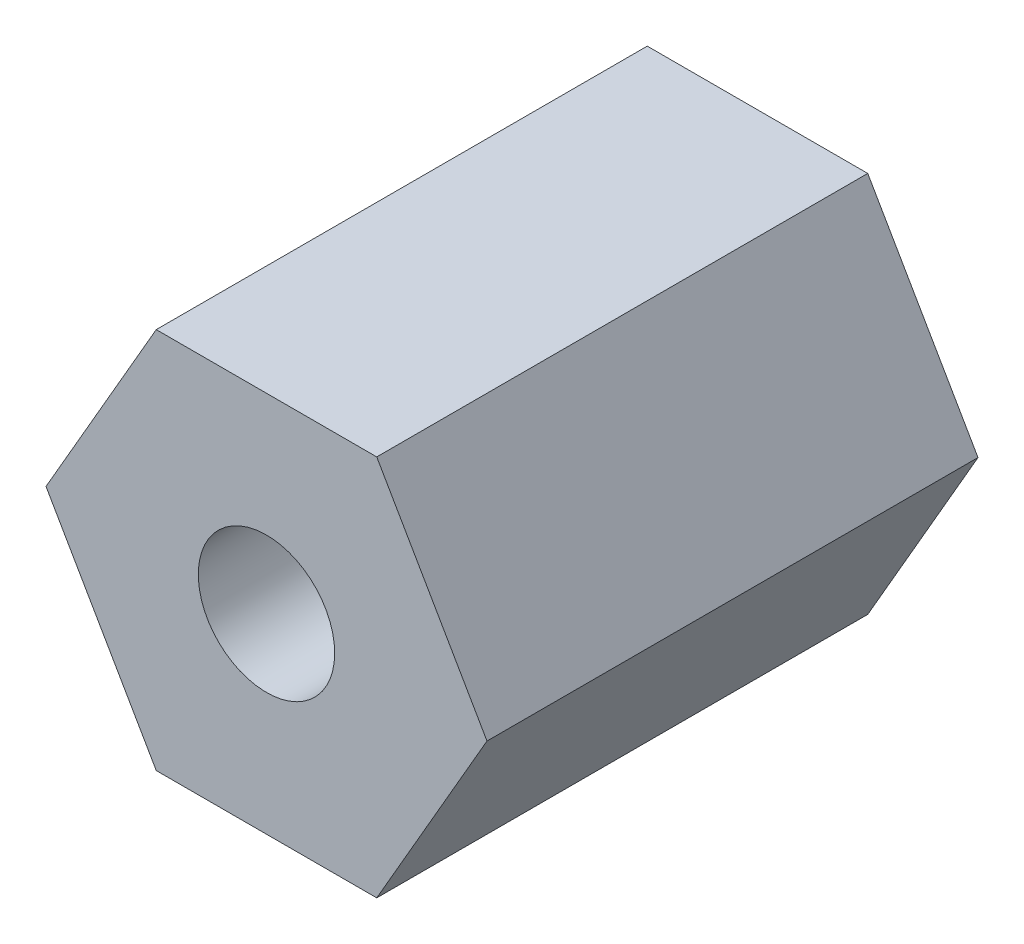
ISO-10303-21;
HEADER;
FILE_DESCRIPTION(('STEP AP214'),'2;1');
FILE_NAME('part.step','',(''),(''),'','','');
FILE_SCHEMA(('AUTOMOTIVE_DESIGN { 1 0 10303 214 1 1 1 1 }'));
ENDSEC;
DATA;
#1=APPLICATION_CONTEXT('core data for automotive mechanical design processes');
#2=APPLICATION_PROTOCOL_DEFINITION('international standard','automotive_design',2000,#1);
#3=PRODUCT_CONTEXT('',#1,'mechanical');
#4=PRODUCT('Part','Part','',(#3));
#5=PRODUCT_RELATED_PRODUCT_CATEGORY('part','',(#4));
#6=PRODUCT_DEFINITION_FORMATION('','',#4);
#7=PRODUCT_DEFINITION_CONTEXT('part definition',#1,'design');
#8=PRODUCT_DEFINITION('design','',#6,#7);
#9=PRODUCT_DEFINITION_SHAPE('','',#8);
#10=(LENGTH_UNIT() NAMED_UNIT(*) SI_UNIT(.MILLI.,.METRE.));
#11=(NAMED_UNIT(*) PLANE_ANGLE_UNIT() SI_UNIT($,.RADIAN.));
#12=(NAMED_UNIT(*) SI_UNIT($,.STERADIAN.) SOLID_ANGLE_UNIT());
#13=UNCERTAINTY_MEASURE_WITH_UNIT(LENGTH_MEASURE(1.E-05),#10,'distance_accuracy_value','');
#14=(GEOMETRIC_REPRESENTATION_CONTEXT(3) GLOBAL_UNCERTAINTY_ASSIGNED_CONTEXT((#13)) GLOBAL_UNIT_ASSIGNED_CONTEXT((#10,
#11,#12)) REPRESENTATION_CONTEXT('',''));
#15=CARTESIAN_POINT('',(0.,0.,0.));
#16=DIRECTION('',(0.,0.,1.));
#17=DIRECTION('',(1.,0.,0.));
#18=AXIS2_PLACEMENT_3D('',#15,#16,#17);
#19=CARTESIAN_POINT('',(2.02072594216369,3.5,9.));
#20=DIRECTION('',(0.,-1.,0.));
#21=DIRECTION('',(1.,0.,0.));
#22=AXIS2_PLACEMENT_3D('',#19,#20,#21);
#23=PLANE('',#22);
#24=DIRECTION('',(-1.,0.,0.));
#25=VECTOR('',#24,1.);
#26=CARTESIAN_POINT('',(2.02072594216369,3.5,0.));
#27=LINE('',#26,#25);
#28=CARTESIAN_POINT('',(2.02072594216369,3.5,0.));
#29=VERTEX_POINT('',#28);
#30=CARTESIAN_POINT('',(-2.02072594216369,3.5,0.));
#31=VERTEX_POINT('',#30);
#32=EDGE_CURVE('E117',#29,#31,#27,.T.);
#33=ORIENTED_EDGE('',*,*,#32,.T.);
#34=DIRECTION('',(0.,0.,-1.));
#35=VECTOR('',#34,1.);
#36=CARTESIAN_POINT('',(-2.02072594216369,3.5,9.));
#37=LINE('',#36,#35);
#38=CARTESIAN_POINT('',(-2.02072594216369,3.5,9.));
#39=VERTEX_POINT('',#38);
#40=EDGE_CURVE('E11',#39,#31,#37,.T.);
#41=ORIENTED_EDGE('',*,*,#40,.F.);
#42=DIRECTION('',(-1.,0.,0.));
#43=VECTOR('',#42,1.);
#44=CARTESIAN_POINT('',(2.02072594216369,3.5,9.));
#45=LINE('',#44,#43);
#46=CARTESIAN_POINT('',(2.02072594216369,3.5,9.));
#47=VERTEX_POINT('',#46);
#48=EDGE_CURVE('E128',#47,#39,#45,.T.);
#49=ORIENTED_EDGE('',*,*,#48,.F.);
#50=DIRECTION('',(0.,0.,-1.));
#51=VECTOR('',#50,1.);
#52=CARTESIAN_POINT('',(2.02072594216369,3.5,9.));
#53=LINE('',#52,#51);
#54=EDGE_CURVE('E113',#47,#29,#53,.T.);
#55=ORIENTED_EDGE('',*,*,#54,.T.);
#56=EDGE_LOOP('',(#33,#41,#49,#55));
#57=FACE_BOUND('',#56,.T.);
#58=ADVANCED_FACE('F33',(#57),#23,.F.);
#59=CARTESIAN_POINT('',(-2.02072594216369,3.5,9.));
#60=DIRECTION('',(0.866025403784439,-0.5,0.));
#61=DIRECTION('',(0.5,0.866025403784439,0.));
#62=AXIS2_PLACEMENT_3D('',#59,#60,#61);
#63=PLANE('',#62);
#64=DIRECTION('',(-0.5,-0.866025403784439,0.));
#65=VECTOR('',#64,1.);
#66=CARTESIAN_POINT('',(-2.02072594216369,3.5,0.));
#67=LINE('',#66,#65);
#68=CARTESIAN_POINT('',(-4.04145188432738,0.,0.));
#69=VERTEX_POINT('',#68);
#70=EDGE_CURVE('E120',#31,#69,#67,.T.);
#71=ORIENTED_EDGE('',*,*,#70,.T.);
#72=DIRECTION('',(0.,0.,-1.));
#73=VECTOR('',#72,1.);
#74=CARTESIAN_POINT('',(-4.04145188432738,0.,9.));
#75=LINE('',#74,#73);
#76=CARTESIAN_POINT('',(-4.04145188432738,0.,9.));
#77=VERTEX_POINT('',#76);
#78=EDGE_CURVE('E41',#77,#69,#75,.T.);
#79=ORIENTED_EDGE('',*,*,#78,.F.);
#80=DIRECTION('',(-0.5,-0.866025403784439,0.));
#81=VECTOR('',#80,1.);
#82=CARTESIAN_POINT('',(-2.02072594216369,3.5,9.));
#83=LINE('',#82,#81);
#84=EDGE_CURVE('E86',#39,#77,#83,.T.);
#85=ORIENTED_EDGE('',*,*,#84,.F.);
#86=ORIENTED_EDGE('',*,*,#40,.T.);
#87=EDGE_LOOP('',(#71,#79,#85,#86));
#88=FACE_BOUND('',#87,.T.);
#89=ADVANCED_FACE('F153',(#88),#63,.F.);
#90=CARTESIAN_POINT('',(-4.04145188432738,0.,9.));
#91=DIRECTION('',(0.866025403784438,0.5,0.));
#92=DIRECTION('',(-0.5,0.866025403784439,0.));
#93=AXIS2_PLACEMENT_3D('',#90,#91,#92);
#94=PLANE('',#93);
#95=DIRECTION('',(0.5,-0.866025403784439,0.));
#96=VECTOR('',#95,1.);
#97=CARTESIAN_POINT('',(-4.04145188432738,0.,0.));
#98=LINE('',#97,#96);
#99=CARTESIAN_POINT('',(-2.02072594216369,-3.5,0.));
#100=VERTEX_POINT('',#99);
#101=EDGE_CURVE('E123',#69,#100,#98,.T.);
#102=ORIENTED_EDGE('',*,*,#101,.T.);
#103=DIRECTION('',(0.,0.,-1.));
#104=VECTOR('',#103,1.);
#105=CARTESIAN_POINT('',(-2.02072594216369,-3.5,9.));
#106=LINE('',#105,#104);
#107=CARTESIAN_POINT('',(-2.02072594216369,-3.5,9.));
#108=VERTEX_POINT('',#107);
#109=EDGE_CURVE('E108',#108,#100,#106,.T.);
#110=ORIENTED_EDGE('',*,*,#109,.F.);
#111=DIRECTION('',(0.5,-0.866025403784439,0.));
#112=VECTOR('',#111,1.);
#113=CARTESIAN_POINT('',(-4.04145188432738,0.,9.));
#114=LINE('',#113,#112);
#115=EDGE_CURVE('E99',#77,#108,#114,.T.);
#116=ORIENTED_EDGE('',*,*,#115,.F.);
#117=ORIENTED_EDGE('',*,*,#78,.T.);
#118=EDGE_LOOP('',(#102,#110,#116,#117));
#119=FACE_BOUND('',#118,.T.);
#120=ADVANCED_FACE('F134',(#119),#94,.F.);
#121=CARTESIAN_POINT('',(-2.02072594216369,-3.5,9.));
#122=DIRECTION('',(0.,1.,0.));
#123=DIRECTION('',(-1.,0.,0.));
#124=AXIS2_PLACEMENT_3D('',#121,#122,#123);
#125=PLANE('',#124);
#126=DIRECTION('',(1.,0.,0.));
#127=VECTOR('',#126,1.);
#128=CARTESIAN_POINT('',(-2.02072594216369,-3.5,0.));
#129=LINE('',#128,#127);
#130=CARTESIAN_POINT('',(2.02072594216369,-3.5,0.));
#131=VERTEX_POINT('',#130);
#132=EDGE_CURVE('E107',#100,#131,#129,.T.);
#133=ORIENTED_EDGE('',*,*,#132,.T.);
#134=DIRECTION('',(0.,0.,-1.));
#135=VECTOR('',#134,1.);
#136=CARTESIAN_POINT('',(2.02072594216369,-3.5,9.));
#137=LINE('',#136,#135);
#138=CARTESIAN_POINT('',(2.02072594216369,-3.5,9.));
#139=VERTEX_POINT('',#138);
#140=EDGE_CURVE('E104',#139,#131,#137,.T.);
#141=ORIENTED_EDGE('',*,*,#140,.F.);
#142=DIRECTION('',(1.,0.,0.));
#143=VECTOR('',#142,1.);
#144=CARTESIAN_POINT('',(-2.02072594216369,-3.5,9.));
#145=LINE('',#144,#143);
#146=EDGE_CURVE('E93',#108,#139,#145,.T.);
#147=ORIENTED_EDGE('',*,*,#146,.F.);
#148=ORIENTED_EDGE('',*,*,#109,.T.);
#149=EDGE_LOOP('',(#133,#141,#147,#148));
#150=FACE_BOUND('',#149,.T.);
#151=ADVANCED_FACE('F105',(#150),#125,.F.);
#152=CARTESIAN_POINT('',(2.02072594216369,-3.5,9.));
#153=DIRECTION('',(-0.866025403784439,0.5,0.));
#154=DIRECTION('',(-0.5,-0.866025403784439,0.));
#155=AXIS2_PLACEMENT_3D('',#152,#153,#154);
#156=PLANE('',#155);
#157=DIRECTION('',(0.5,0.866025403784439,0.));
#158=VECTOR('',#157,1.);
#159=CARTESIAN_POINT('',(2.02072594216369,-3.5,0.));
#160=LINE('',#159,#158);
#161=CARTESIAN_POINT('',(4.04145188432738,0.,0.));
#162=VERTEX_POINT('',#161);
#163=EDGE_CURVE('E72',#131,#162,#160,.T.);
#164=ORIENTED_EDGE('',*,*,#163,.T.);
#165=DIRECTION('',(0.,0.,-1.));
#166=VECTOR('',#165,1.);
#167=CARTESIAN_POINT('',(4.04145188432738,0.,9.));
#168=LINE('',#167,#166);
#169=CARTESIAN_POINT('',(4.04145188432738,0.,9.));
#170=VERTEX_POINT('',#169);
#171=EDGE_CURVE('E109',#170,#162,#168,.T.);
#172=ORIENTED_EDGE('',*,*,#171,.F.);
#173=DIRECTION('',(0.5,0.866025403784439,0.));
#174=VECTOR('',#173,1.);
#175=CARTESIAN_POINT('',(2.02072594216369,-3.5,9.));
#176=LINE('',#175,#174);
#177=EDGE_CURVE('E97',#139,#170,#176,.T.);
#178=ORIENTED_EDGE('',*,*,#177,.F.);
#179=ORIENTED_EDGE('',*,*,#140,.T.);
#180=EDGE_LOOP('',(#164,#172,#178,#179));
#181=FACE_BOUND('',#180,.T.);
#182=ADVANCED_FACE('F111',(#181),#156,.F.);
#183=CARTESIAN_POINT('',(4.04145188432738,0.,9.));
#184=DIRECTION('',(-0.866025403784439,-0.5,0.));
#185=DIRECTION('',(0.5,-0.866025403784439,0.));
#186=AXIS2_PLACEMENT_3D('',#183,#184,#185);
#187=PLANE('',#186);
#188=DIRECTION('',(-0.5,0.866025403784438,0.));
#189=VECTOR('',#188,1.);
#190=CARTESIAN_POINT('',(4.04145188432738,0.,0.));
#191=LINE('',#190,#189);
#192=EDGE_CURVE('E78',#162,#29,#191,.T.);
#193=ORIENTED_EDGE('',*,*,#192,.T.);
#194=ORIENTED_EDGE('',*,*,#54,.F.);
#195=DIRECTION('',(-0.5,0.866025403784438,0.));
#196=VECTOR('',#195,1.);
#197=CARTESIAN_POINT('',(4.04145188432738,0.,9.));
#198=LINE('',#197,#196);
#199=EDGE_CURVE('E49',#170,#47,#198,.T.);
#200=ORIENTED_EDGE('',*,*,#199,.F.);
#201=ORIENTED_EDGE('',*,*,#171,.T.);
#202=EDGE_LOOP('',(#193,#194,#200,#201));
#203=FACE_BOUND('',#202,.T.);
#204=ADVANCED_FACE('F141',(#203),#187,.F.);
#205=CARTESIAN_POINT('',(0.,0.,9.));
#206=DIRECTION('',(0.,0.,1.));
#207=DIRECTION('',(1.,0.,0.));
#208=AXIS2_PLACEMENT_3D('',#205,#206,#207);
#209=PLANE('',#208);
#210=CARTESIAN_POINT('',(0.,0.,9.));
#211=DIRECTION('',(0.,0.,1.));
#212=DIRECTION('',(1.,0.,0.));
#213=AXIS2_PLACEMENT_3D('',#210,#211,#212);
#214=CIRCLE('',#213,1.24999999999999);
#215=CARTESIAN_POINT('',(1.24999999999999,0.,9.));
#216=VERTEX_POINT('',#215);
#217=EDGE_CURVE('E208',#216,#216,#214,.T.);
#218=ORIENTED_EDGE('',*,*,#217,.F.);
#219=EDGE_LOOP('',(#218));
#220=FACE_BOUND('',#219,.T.);
#221=ORIENTED_EDGE('',*,*,#48,.T.);
#222=ORIENTED_EDGE('',*,*,#84,.T.);
#223=ORIENTED_EDGE('',*,*,#115,.T.);
#224=ORIENTED_EDGE('',*,*,#146,.T.);
#225=ORIENTED_EDGE('',*,*,#177,.T.);
#226=ORIENTED_EDGE('',*,*,#199,.T.);
#227=EDGE_LOOP('',(#221,#222,#223,#224,#225,#226));
#228=FACE_BOUND('',#227,.T.);
#229=ADVANCED_FACE('F95',(#220,#228),#209,.T.);
#230=CARTESIAN_POINT('',(0.,0.,0.));
#231=DIRECTION('',(0.,0.,1.));
#232=DIRECTION('',(1.,0.,0.));
#233=AXIS2_PLACEMENT_3D('',#230,#231,#232);
#234=PLANE('',#233);
#235=CARTESIAN_POINT('',(0.,0.,0.));
#236=DIRECTION('',(0.,0.,1.));
#237=DIRECTION('',(1.,0.,0.));
#238=AXIS2_PLACEMENT_3D('',#235,#236,#237);
#239=CIRCLE('',#238,1.25);
#240=CARTESIAN_POINT('',(1.25,0.,0.));
#241=VERTEX_POINT('',#240);
#242=EDGE_CURVE('E121',#241,#241,#239,.T.);
#243=ORIENTED_EDGE('',*,*,#242,.T.);
#244=EDGE_LOOP('',(#243));
#245=FACE_BOUND('',#244,.T.);
#246=ORIENTED_EDGE('',*,*,#32,.F.);
#247=ORIENTED_EDGE('',*,*,#192,.F.);
#248=ORIENTED_EDGE('',*,*,#163,.F.);
#249=ORIENTED_EDGE('',*,*,#132,.F.);
#250=ORIENTED_EDGE('',*,*,#101,.F.);
#251=ORIENTED_EDGE('',*,*,#70,.F.);
#252=EDGE_LOOP('',(#246,#247,#248,#249,#250,#251));
#253=FACE_BOUND('',#252,.T.);
#254=ADVANCED_FACE('F137',(#245,#253),#234,.F.);
#255=CARTESIAN_POINT('',(0.,0.,9.));
#256=DIRECTION('',(0.,0.,1.));
#257=DIRECTION('',(1.,0.,0.));
#258=AXIS2_PLACEMENT_3D('',#255,#256,#257);
#259=CYLINDRICAL_SURFACE('',#258,1.24999999999999);
#260=ORIENTED_EDGE('',*,*,#242,.F.);
#261=EDGE_LOOP('',(#260));
#262=FACE_BOUND('',#261,.T.);
#263=ORIENTED_EDGE('',*,*,#217,.T.);
#264=EDGE_LOOP('',(#263));
#265=FACE_BOUND('',#264,.T.);
#266=ADVANCED_FACE('F190',(#262,#265),#259,.F.);
#267=CLOSED_SHELL('',(#58,#89,#120,#151,#182,#204,#229,#254,#266));
#268=MANIFOLD_SOLID_BREP('B2',#267);
#269=ADVANCED_BREP_SHAPE_REPRESENTATION('',(#18,#268),#14);
#270=SHAPE_DEFINITION_REPRESENTATION(#9,#269);
ENDSEC;
END-ISO-10303-21;
